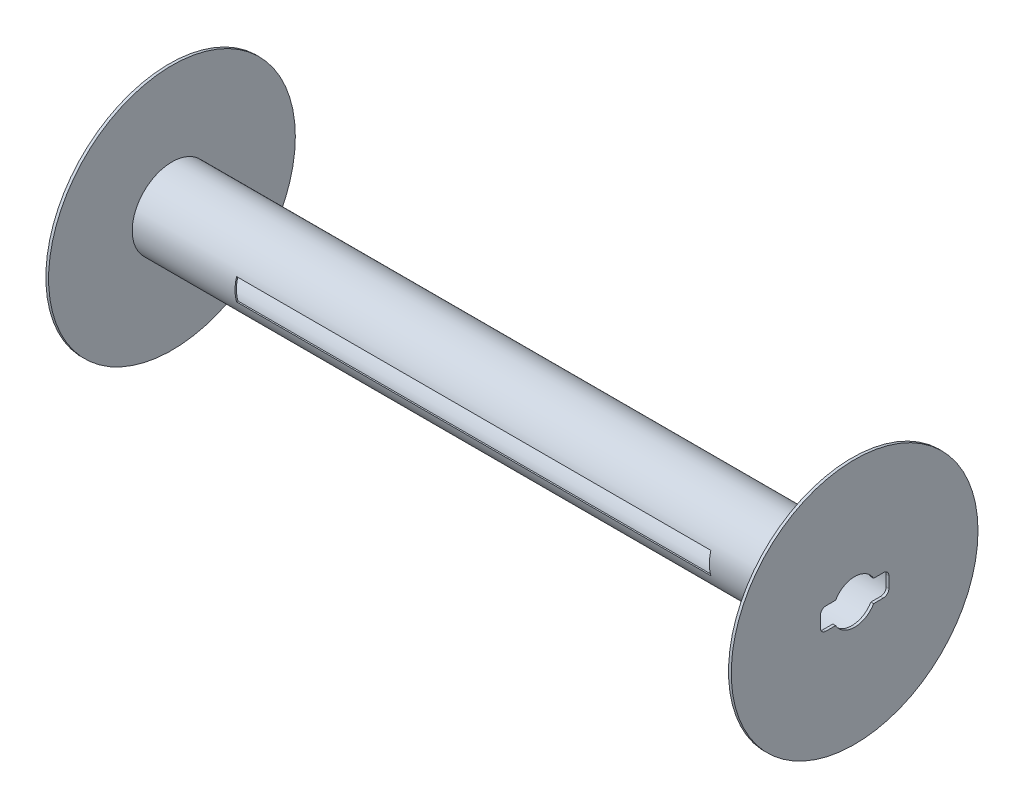
ISO-10303-21;
HEADER;
FILE_DESCRIPTION(('STEP AP214'),'2;1');
FILE_NAME('part.step','',(''),(''),'','','');
FILE_SCHEMA(('AUTOMOTIVE_DESIGN { 1 0 10303 214 1 1 1 1 }'));
ENDSEC;
DATA;
#1=APPLICATION_CONTEXT('core data for automotive mechanical design processes');
#2=APPLICATION_PROTOCOL_DEFINITION('international standard','automotive_design',2000,#1);
#3=PRODUCT_CONTEXT('',#1,'mechanical');
#4=PRODUCT('Part','Part','',(#3));
#5=PRODUCT_RELATED_PRODUCT_CATEGORY('part','',(#4));
#6=PRODUCT_DEFINITION_FORMATION('','',#4);
#7=PRODUCT_DEFINITION_CONTEXT('part definition',#1,'design');
#8=PRODUCT_DEFINITION('design','',#6,#7);
#9=PRODUCT_DEFINITION_SHAPE('','',#8);
#10=(LENGTH_UNIT() NAMED_UNIT(*) SI_UNIT(.MILLI.,.METRE.));
#11=(NAMED_UNIT(*) PLANE_ANGLE_UNIT() SI_UNIT($,.RADIAN.));
#12=(NAMED_UNIT(*) SI_UNIT($,.STERADIAN.) SOLID_ANGLE_UNIT());
#13=UNCERTAINTY_MEASURE_WITH_UNIT(LENGTH_MEASURE(1.E-05),#10,'distance_accuracy_value','');
#14=(GEOMETRIC_REPRESENTATION_CONTEXT(3) GLOBAL_UNCERTAINTY_ASSIGNED_CONTEXT((#13)) GLOBAL_UNIT_ASSIGNED_CONTEXT((#10,
#11,#12)) REPRESENTATION_CONTEXT('',''));
#15=CARTESIAN_POINT('',(0.,0.,0.));
#16=DIRECTION('',(0.,0.,1.));
#17=DIRECTION('',(1.,0.,0.));
#18=AXIS2_PLACEMENT_3D('',#15,#16,#17);
#19=CARTESIAN_POINT('',(0.,0.,0.));
#20=DIRECTION('',(1.,0.,0.));
#21=DIRECTION('',(0.,0.,-1.));
#22=AXIS2_PLACEMENT_3D('',#19,#20,#21);
#23=PLANE('',#22);
#24=CARTESIAN_POINT('',(0.,0.,0.));
#25=DIRECTION('',(1.,0.,0.));
#26=DIRECTION('',(0.,0.,-1.));
#27=AXIS2_PLACEMENT_3D('',#24,#25,#26);
#28=CIRCLE('',#27,11.43);
#29=CARTESIAN_POINT('',(0.,0.,-11.43));
#30=VERTEX_POINT('',#29);
#31=EDGE_CURVE('E522',#30,#30,#28,.T.);
#32=ORIENTED_EDGE('',*,*,#31,.F.);
#33=EDGE_LOOP('',(#32));
#34=FACE_BOUND('',#33,.T.);
#35=DIRECTION('',(0.,0.,-1.));
#36=VECTOR('',#35,1.);
#37=CARTESIAN_POINT('',(0.,1.016,0.));
#38=LINE('',#37,#36);
#39=CARTESIAN_POINT('',(0.,1.016,2.667));
#40=VERTEX_POINT('',#39);
#41=CARTESIAN_POINT('',(0.,1.016,1.75976362048998));
#42=VERTEX_POINT('',#41);
#43=EDGE_CURVE('E257',#40,#42,#38,.T.);
#44=ORIENTED_EDGE('',*,*,#43,.F.);
#45=CARTESIAN_POINT('',(0.,0.508,2.667));
#46=DIRECTION('',(1.,0.,0.));
#47=DIRECTION('',(0.,0.,-1.));
#48=AXIS2_PLACEMENT_3D('',#45,#46,#47);
#49=CIRCLE('',#48,0.508);
#50=CARTESIAN_POINT('',(0.,0.508,3.175));
#51=VERTEX_POINT('',#50);
#52=EDGE_CURVE('E267',#40,#51,#49,.T.);
#53=ORIENTED_EDGE('',*,*,#52,.T.);
#54=DIRECTION('',(0.,1.,0.));
#55=VECTOR('',#54,1.);
#56=CARTESIAN_POINT('',(0.,0.,3.175));
#57=LINE('',#56,#55);
#58=CARTESIAN_POINT('',(0.,-0.508,3.175));
#59=VERTEX_POINT('',#58);
#60=EDGE_CURVE('E272',#59,#51,#57,.T.);
#61=ORIENTED_EDGE('',*,*,#60,.F.);
#62=CARTESIAN_POINT('',(0.,-0.508,2.667));
#63=DIRECTION('',(1.,0.,0.));
#64=DIRECTION('',(0.,0.,-1.));
#65=AXIS2_PLACEMENT_3D('',#62,#63,#64);
#66=CIRCLE('',#65,0.508);
#67=CARTESIAN_POINT('',(0.,-1.016,2.667));
#68=VERTEX_POINT('',#67);
#69=EDGE_CURVE('E290',#59,#68,#66,.T.);
#70=ORIENTED_EDGE('',*,*,#69,.T.);
#71=DIRECTION('',(0.,0.,1.));
#72=VECTOR('',#71,1.);
#73=CARTESIAN_POINT('',(0.,-1.016,0.));
#74=LINE('',#73,#72);
#75=CARTESIAN_POINT('',(0.,-1.016,1.75976362048998));
#76=VERTEX_POINT('',#75);
#77=EDGE_CURVE('E294',#76,#68,#74,.T.);
#78=ORIENTED_EDGE('',*,*,#77,.F.);
#79=CARTESIAN_POINT('',(0.,0.,0.));
#80=DIRECTION('',(1.,0.,0.));
#81=DIRECTION('',(0.,0.,-1.));
#82=AXIS2_PLACEMENT_3D('',#79,#80,#81);
#83=CIRCLE('',#82,2.032);
#84=CARTESIAN_POINT('',(0.,-1.016,-1.75976362048998));
#85=VERTEX_POINT('',#84);
#86=EDGE_CURVE('E297',#76,#85,#83,.T.);
#87=ORIENTED_EDGE('',*,*,#86,.T.);
#88=DIRECTION('',(0.,0.,1.));
#89=VECTOR('',#88,1.);
#90=CARTESIAN_POINT('',(0.,-1.016,0.));
#91=LINE('',#90,#89);
#92=CARTESIAN_POINT('',(0.,-1.016,-2.667));
#93=VERTEX_POINT('',#92);
#94=EDGE_CURVE('E301',#93,#85,#91,.T.);
#95=ORIENTED_EDGE('',*,*,#94,.F.);
#96=CARTESIAN_POINT('',(0.,-0.507999999999999,-2.667));
#97=DIRECTION('',(1.,0.,0.));
#98=DIRECTION('',(0.,0.,-1.));
#99=AXIS2_PLACEMENT_3D('',#96,#97,#98);
#100=CIRCLE('',#99,0.508);
#101=CARTESIAN_POINT('',(0.,-0.508,-3.175));
#102=VERTEX_POINT('',#101);
#103=EDGE_CURVE('E304',#102,#93,#100,.F.);
#104=ORIENTED_EDGE('',*,*,#103,.F.);
#105=DIRECTION('',(0.,1.,0.));
#106=VECTOR('',#105,1.);
#107=CARTESIAN_POINT('',(0.,0.,-3.175));
#108=LINE('',#107,#106);
#109=CARTESIAN_POINT('',(0.,0.508,-3.175));
#110=VERTEX_POINT('',#109);
#111=EDGE_CURVE('E307',#102,#110,#108,.T.);
#112=ORIENTED_EDGE('',*,*,#111,.T.);
#113=CARTESIAN_POINT('',(0.,0.508,-2.667));
#114=DIRECTION('',(1.,0.,0.));
#115=DIRECTION('',(0.,0.,-1.));
#116=AXIS2_PLACEMENT_3D('',#113,#114,#115);
#117=CIRCLE('',#116,0.508);
#118=CARTESIAN_POINT('',(0.,1.016,-2.667));
#119=VERTEX_POINT('',#118);
#120=EDGE_CURVE('E311',#119,#110,#117,.F.);
#121=ORIENTED_EDGE('',*,*,#120,.F.);
#122=DIRECTION('',(0.,0.,1.));
#123=VECTOR('',#122,1.);
#124=CARTESIAN_POINT('',(0.,1.016,0.));
#125=LINE('',#124,#123);
#126=CARTESIAN_POINT('',(0.,1.016,-1.75976362048998));
#127=VERTEX_POINT('',#126);
#128=EDGE_CURVE('E314',#119,#127,#125,.T.);
#129=ORIENTED_EDGE('',*,*,#128,.T.);
#130=EDGE_CURVE('E277',#127,#42,#83,.T.);
#131=ORIENTED_EDGE('',*,*,#130,.T.);
#132=EDGE_LOOP('',(#44,#53,#61,#70,#78,#87,#95,#104,#112,#121,#129,#131));
#133=FACE_BOUND('',#132,.T.);
#134=ADVANCED_FACE('F43',(#34,#133),#23,.F.);
#135=CARTESIAN_POINT('',(63.5,0.,0.));
#136=DIRECTION('',(1.,0.,0.));
#137=DIRECTION('',(0.,0.,-1.));
#138=AXIS2_PLACEMENT_3D('',#135,#136,#137);
#139=PLANE('',#138);
#140=CARTESIAN_POINT('',(63.5,0.,0.));
#141=DIRECTION('',(1.,0.,0.));
#142=DIRECTION('',(0.,0.,-1.));
#143=AXIS2_PLACEMENT_3D('',#140,#141,#142);
#144=CIRCLE('',#143,11.43);
#145=CARTESIAN_POINT('',(63.5,0.,-11.43));
#146=VERTEX_POINT('',#145);
#147=EDGE_CURVE('E506',#146,#146,#144,.T.);
#148=ORIENTED_EDGE('',*,*,#147,.T.);
#149=EDGE_LOOP('',(#148));
#150=FACE_BOUND('',#149,.T.);
#151=CARTESIAN_POINT('',(63.5,0.508,2.667));
#152=DIRECTION('',(1.,0.,0.));
#153=DIRECTION('',(0.,0.,-1.));
#154=AXIS2_PLACEMENT_3D('',#151,#152,#153);
#155=CIRCLE('',#154,0.508);
#156=CARTESIAN_POINT('',(63.5,1.016,2.667));
#157=VERTEX_POINT('',#156);
#158=CARTESIAN_POINT('',(63.5,0.508,3.175));
#159=VERTEX_POINT('',#158);
#160=EDGE_CURVE('E319',#157,#159,#155,.T.);
#161=ORIENTED_EDGE('',*,*,#160,.F.);
#162=DIRECTION('',(0.,0.,-1.));
#163=VECTOR('',#162,1.);
#164=CARTESIAN_POINT('',(63.5,1.016,0.));
#165=LINE('',#164,#163);
#166=CARTESIAN_POINT('',(63.5,1.016,1.75976362048998));
#167=VERTEX_POINT('',#166);
#168=EDGE_CURVE('E67',#157,#167,#165,.T.);
#169=ORIENTED_EDGE('',*,*,#168,.T.);
#170=CARTESIAN_POINT('',(63.5,0.,0.));
#171=DIRECTION('',(1.,0.,0.));
#172=DIRECTION('',(0.,0.,-1.));
#173=AXIS2_PLACEMENT_3D('',#170,#171,#172);
#174=CIRCLE('',#173,2.032);
#175=CARTESIAN_POINT('',(63.5,1.016,-1.75976362048998));
#176=VERTEX_POINT('',#175);
#177=EDGE_CURVE('E279',#176,#167,#174,.T.);
#178=ORIENTED_EDGE('',*,*,#177,.F.);
#179=DIRECTION('',(0.,0.,1.));
#180=VECTOR('',#179,1.);
#181=CARTESIAN_POINT('',(63.5,1.016,0.));
#182=LINE('',#181,#180);
#183=CARTESIAN_POINT('',(63.5,1.016,-2.667));
#184=VERTEX_POINT('',#183);
#185=EDGE_CURVE('E284',#184,#176,#182,.T.);
#186=ORIENTED_EDGE('',*,*,#185,.F.);
#187=CARTESIAN_POINT('',(63.5,0.508,-2.667));
#188=DIRECTION('',(1.,0.,0.));
#189=DIRECTION('',(0.,0.,-1.));
#190=AXIS2_PLACEMENT_3D('',#187,#188,#189);
#191=CIRCLE('',#190,0.508);
#192=CARTESIAN_POINT('',(63.5,0.508,-3.175));
#193=VERTEX_POINT('',#192);
#194=EDGE_CURVE('E349',#184,#193,#191,.F.);
#195=ORIENTED_EDGE('',*,*,#194,.T.);
#196=DIRECTION('',(0.,1.,0.));
#197=VECTOR('',#196,1.);
#198=CARTESIAN_POINT('',(63.5,0.,-3.175));
#199=LINE('',#198,#197);
#200=CARTESIAN_POINT('',(63.5,-0.508,-3.175));
#201=VERTEX_POINT('',#200);
#202=EDGE_CURVE('E345',#201,#193,#199,.T.);
#203=ORIENTED_EDGE('',*,*,#202,.F.);
#204=CARTESIAN_POINT('',(63.5,-0.507999999999999,-2.667));
#205=DIRECTION('',(1.,0.,0.));
#206=DIRECTION('',(0.,0.,-1.));
#207=AXIS2_PLACEMENT_3D('',#204,#205,#206);
#208=CIRCLE('',#207,0.508);
#209=CARTESIAN_POINT('',(63.5,-1.016,-2.667));
#210=VERTEX_POINT('',#209);
#211=EDGE_CURVE('E341',#201,#210,#208,.F.);
#212=ORIENTED_EDGE('',*,*,#211,.T.);
#213=DIRECTION('',(0.,0.,1.));
#214=VECTOR('',#213,1.);
#215=CARTESIAN_POINT('',(63.5,-1.016,0.));
#216=LINE('',#215,#214);
#217=CARTESIAN_POINT('',(63.5,-1.016,-1.75976362048998));
#218=VERTEX_POINT('',#217);
#219=EDGE_CURVE('E337',#210,#218,#216,.T.);
#220=ORIENTED_EDGE('',*,*,#219,.T.);
#221=CARTESIAN_POINT('',(63.5,-1.016,1.75976362048998));
#222=VERTEX_POINT('',#221);
#223=EDGE_CURVE('E286',#222,#218,#174,.T.);
#224=ORIENTED_EDGE('',*,*,#223,.F.);
#225=DIRECTION('',(0.,0.,1.));
#226=VECTOR('',#225,1.);
#227=CARTESIAN_POINT('',(63.5,-1.016,0.));
#228=LINE('',#227,#226);
#229=CARTESIAN_POINT('',(63.5,-1.016,2.667));
#230=VERTEX_POINT('',#229);
#231=EDGE_CURVE('E331',#222,#230,#228,.T.);
#232=ORIENTED_EDGE('',*,*,#231,.T.);
#233=CARTESIAN_POINT('',(63.5,-0.508,2.667));
#234=DIRECTION('',(1.,0.,0.));
#235=DIRECTION('',(0.,0.,-1.));
#236=AXIS2_PLACEMENT_3D('',#233,#234,#235);
#237=CIRCLE('',#236,0.508);
#238=CARTESIAN_POINT('',(63.5,-0.508,3.175));
#239=VERTEX_POINT('',#238);
#240=EDGE_CURVE('E327',#239,#230,#237,.T.);
#241=ORIENTED_EDGE('',*,*,#240,.F.);
#242=DIRECTION('',(0.,1.,0.));
#243=VECTOR('',#242,1.);
#244=CARTESIAN_POINT('',(63.5,0.,3.175));
#245=LINE('',#244,#243);
#246=EDGE_CURVE('E323',#239,#159,#245,.T.);
#247=ORIENTED_EDGE('',*,*,#246,.T.);
#248=EDGE_LOOP('',(#161,#169,#178,#186,#195,#203,#212,#220,#224,#232,#241,#247));
#249=FACE_BOUND('',#248,.T.);
#250=ADVANCED_FACE('F667',(#150,#249),#139,.T.);
#251=CARTESIAN_POINT('',(0.254,0.,0.));
#252=DIRECTION('',(1.,0.,0.));
#253=DIRECTION('',(0.,0.,-1.));
#254=AXIS2_PLACEMENT_3D('',#251,#252,#253);
#255=PLANE('',#254);
#256=CARTESIAN_POINT('',(0.254000000000004,0.,0.));
#257=DIRECTION('',(1.,0.,0.));
#258=DIRECTION('',(0.,0.,-1.));
#259=AXIS2_PLACEMENT_3D('',#256,#257,#258);
#260=CIRCLE('',#259,3.556);
#261=CARTESIAN_POINT('',(0.254000000000004,0.,-3.556));
#262=VERTEX_POINT('',#261);
#263=EDGE_CURVE('E530',#262,#262,#260,.F.);
#264=ORIENTED_EDGE('',*,*,#263,.F.);
#265=EDGE_LOOP('',(#264));
#266=FACE_BOUND('',#265,.T.);
#267=CARTESIAN_POINT('',(0.254,0.508,2.667));
#268=DIRECTION('',(1.,0.,0.));
#269=DIRECTION('',(0.,0.,-1.));
#270=AXIS2_PLACEMENT_3D('',#267,#268,#269);
#271=CIRCLE('',#270,0.508);
#272=CARTESIAN_POINT('',(0.254,1.016,2.667));
#273=VERTEX_POINT('',#272);
#274=CARTESIAN_POINT('',(0.254,0.508,3.175));
#275=VERTEX_POINT('',#274);
#276=EDGE_CURVE('E359',#273,#275,#271,.T.);
#277=ORIENTED_EDGE('',*,*,#276,.F.);
#278=DIRECTION('',(0.,0.,-1.));
#279=VECTOR('',#278,1.);
#280=CARTESIAN_POINT('',(0.254,1.016,0.));
#281=LINE('',#280,#279);
#282=CARTESIAN_POINT('',(0.254,1.016,1.75976362048998));
#283=VERTEX_POINT('',#282);
#284=EDGE_CURVE('E260',#273,#283,#281,.T.);
#285=ORIENTED_EDGE('',*,*,#284,.T.);
#286=CARTESIAN_POINT('',(0.254,0.,0.));
#287=DIRECTION('',(1.,0.,0.));
#288=DIRECTION('',(0.,0.,-1.));
#289=AXIS2_PLACEMENT_3D('',#286,#287,#288);
#290=CIRCLE('',#289,2.032);
#291=CARTESIAN_POINT('',(0.254,1.016,-1.75976362048998));
#292=VERTEX_POINT('',#291);
#293=EDGE_CURVE('E442',#292,#283,#290,.T.);
#294=ORIENTED_EDGE('',*,*,#293,.F.);
#295=DIRECTION('',(0.,0.,1.));
#296=VECTOR('',#295,1.);
#297=CARTESIAN_POINT('',(0.254,1.016,0.));
#298=LINE('',#297,#296);
#299=CARTESIAN_POINT('',(0.254,1.016,-2.667));
#300=VERTEX_POINT('',#299);
#301=EDGE_CURVE('E439',#300,#292,#298,.T.);
#302=ORIENTED_EDGE('',*,*,#301,.F.);
#303=CARTESIAN_POINT('',(0.254,0.508,-2.667));
#304=DIRECTION('',(1.,0.,0.));
#305=DIRECTION('',(0.,0.,-1.));
#306=AXIS2_PLACEMENT_3D('',#303,#304,#305);
#307=CIRCLE('',#306,0.508);
#308=CARTESIAN_POINT('',(0.254,0.508,-3.175));
#309=VERTEX_POINT('',#308);
#310=EDGE_CURVE('E435',#300,#309,#307,.F.);
#311=ORIENTED_EDGE('',*,*,#310,.T.);
#312=DIRECTION('',(0.,1.,0.));
#313=VECTOR('',#312,1.);
#314=CARTESIAN_POINT('',(0.254,0.,-3.175));
#315=LINE('',#314,#313);
#316=CARTESIAN_POINT('',(0.254,-0.508,-3.175));
#317=VERTEX_POINT('',#316);
#318=EDGE_CURVE('E432',#317,#309,#315,.T.);
#319=ORIENTED_EDGE('',*,*,#318,.F.);
#320=CARTESIAN_POINT('',(0.254,-0.507999999999999,-2.667));
#321=DIRECTION('',(1.,0.,0.));
#322=DIRECTION('',(0.,0.,-1.));
#323=AXIS2_PLACEMENT_3D('',#320,#321,#322);
#324=CIRCLE('',#323,0.508);
#325=CARTESIAN_POINT('',(0.254,-1.016,-2.667));
#326=VERTEX_POINT('',#325);
#327=EDGE_CURVE('E428',#317,#326,#324,.F.);
#328=ORIENTED_EDGE('',*,*,#327,.T.);
#329=DIRECTION('',(0.,0.,1.));
#330=VECTOR('',#329,1.);
#331=CARTESIAN_POINT('',(0.254,-1.016,0.));
#332=LINE('',#331,#330);
#333=CARTESIAN_POINT('',(0.254,-1.016,-1.75976362048998));
#334=VERTEX_POINT('',#333);
#335=EDGE_CURVE('E424',#326,#334,#332,.T.);
#336=ORIENTED_EDGE('',*,*,#335,.T.);
#337=CARTESIAN_POINT('',(0.254,0.,0.));
#338=DIRECTION('',(1.,0.,0.));
#339=DIRECTION('',(0.,0.,-1.));
#340=AXIS2_PLACEMENT_3D('',#337,#338,#339);
#341=CIRCLE('',#340,2.032);
#342=CARTESIAN_POINT('',(0.254,-1.016,1.75976362048998));
#343=VERTEX_POINT('',#342);
#344=EDGE_CURVE('E421',#343,#334,#341,.T.);
#345=ORIENTED_EDGE('',*,*,#344,.F.);
#346=DIRECTION('',(0.,0.,1.));
#347=VECTOR('',#346,1.);
#348=CARTESIAN_POINT('',(0.254,-1.016,0.));
#349=LINE('',#348,#347);
#350=CARTESIAN_POINT('',(0.254,-1.016,2.667));
#351=VERTEX_POINT('',#350);
#352=EDGE_CURVE('E417',#343,#351,#349,.T.);
#353=ORIENTED_EDGE('',*,*,#352,.T.);
#354=CARTESIAN_POINT('',(0.254,-0.508,2.667));
#355=DIRECTION('',(1.,0.,0.));
#356=DIRECTION('',(0.,0.,-1.));
#357=AXIS2_PLACEMENT_3D('',#354,#355,#356);
#358=CIRCLE('',#357,0.508);
#359=CARTESIAN_POINT('',(0.254,-0.508,3.175));
#360=VERTEX_POINT('',#359);
#361=EDGE_CURVE('E414',#360,#351,#358,.T.);
#362=ORIENTED_EDGE('',*,*,#361,.F.);
#363=DIRECTION('',(0.,1.,0.));
#364=VECTOR('',#363,1.);
#365=CARTESIAN_POINT('',(0.254,0.,3.175));
#366=LINE('',#365,#364);
#367=EDGE_CURVE('E410',#360,#275,#366,.T.);
#368=ORIENTED_EDGE('',*,*,#367,.T.);
#369=EDGE_LOOP('',(#277,#285,#294,#302,#311,#319,#328,#336,#345,#353,#362,#368));
#370=FACE_BOUND('',#369,.T.);
#371=ADVANCED_FACE('F721',(#266,#370),#255,.T.);
#372=CARTESIAN_POINT('',(63.246,0.,0.));
#373=DIRECTION('',(1.,0.,0.));
#374=DIRECTION('',(0.,0.,-1.));
#375=AXIS2_PLACEMENT_3D('',#372,#373,#374);
#376=PLANE('',#375);
#377=CARTESIAN_POINT('',(63.246,0.,0.));
#378=DIRECTION('',(1.,0.,0.));
#379=DIRECTION('',(0.,0.,-1.));
#380=AXIS2_PLACEMENT_3D('',#377,#378,#379);
#381=CIRCLE('',#380,3.556);
#382=CARTESIAN_POINT('',(63.246,0.,-3.556));
#383=VERTEX_POINT('',#382);
#384=EDGE_CURVE('E510',#383,#383,#381,.T.);
#385=ORIENTED_EDGE('',*,*,#384,.F.);
#386=EDGE_LOOP('',(#385));
#387=FACE_BOUND('',#386,.T.);
#388=DIRECTION('',(0.,0.,-1.));
#389=VECTOR('',#388,1.);
#390=CARTESIAN_POINT('',(63.246,1.016,0.));
#391=LINE('',#390,#389);
#392=CARTESIAN_POINT('',(63.246,1.016,2.667));
#393=VERTEX_POINT('',#392);
#394=CARTESIAN_POINT('',(63.246,1.016,1.75976362048998));
#395=VERTEX_POINT('',#394);
#396=EDGE_CURVE('E11',#393,#395,#391,.T.);
#397=ORIENTED_EDGE('',*,*,#396,.F.);
#398=CARTESIAN_POINT('',(63.246,0.508,2.667));
#399=DIRECTION('',(1.,0.,0.));
#400=DIRECTION('',(0.,0.,-1.));
#401=AXIS2_PLACEMENT_3D('',#398,#399,#400);
#402=CIRCLE('',#401,0.508);
#403=CARTESIAN_POINT('',(63.246,0.508,3.175));
#404=VERTEX_POINT('',#403);
#405=EDGE_CURVE('E566',#393,#404,#402,.T.);
#406=ORIENTED_EDGE('',*,*,#405,.T.);
#407=DIRECTION('',(0.,1.,0.));
#408=VECTOR('',#407,1.);
#409=CARTESIAN_POINT('',(63.246,0.,3.175));
#410=LINE('',#409,#408);
#411=CARTESIAN_POINT('',(63.246,-0.508,3.175));
#412=VERTEX_POINT('',#411);
#413=EDGE_CURVE('E570',#412,#404,#410,.T.);
#414=ORIENTED_EDGE('',*,*,#413,.F.);
#415=CARTESIAN_POINT('',(63.246,-0.508,2.667));
#416=DIRECTION('',(1.,0.,0.));
#417=DIRECTION('',(0.,0.,-1.));
#418=AXIS2_PLACEMENT_3D('',#415,#416,#417);
#419=CIRCLE('',#418,0.508);
#420=CARTESIAN_POINT('',(63.246,-1.016,2.667));
#421=VERTEX_POINT('',#420);
#422=EDGE_CURVE('E574',#412,#421,#419,.T.);
#423=ORIENTED_EDGE('',*,*,#422,.T.);
#424=DIRECTION('',(0.,0.,1.));
#425=VECTOR('',#424,1.);
#426=CARTESIAN_POINT('',(63.246,-1.016,0.));
#427=LINE('',#426,#425);
#428=CARTESIAN_POINT('',(63.246,-1.016,1.75976362048998));
#429=VERTEX_POINT('',#428);
#430=EDGE_CURVE('E578',#429,#421,#427,.T.);
#431=ORIENTED_EDGE('',*,*,#430,.F.);
#432=CARTESIAN_POINT('',(63.246,0.,0.));
#433=DIRECTION('',(1.,0.,0.));
#434=DIRECTION('',(0.,0.,-1.));
#435=AXIS2_PLACEMENT_3D('',#432,#433,#434);
#436=CIRCLE('',#435,2.032);
#437=CARTESIAN_POINT('',(63.246,-1.016,-1.75976362048998));
#438=VERTEX_POINT('',#437);
#439=EDGE_CURVE('E581',#429,#438,#436,.T.);
#440=ORIENTED_EDGE('',*,*,#439,.T.);
#441=DIRECTION('',(0.,0.,1.));
#442=VECTOR('',#441,1.);
#443=CARTESIAN_POINT('',(63.246,-1.016,0.));
#444=LINE('',#443,#442);
#445=CARTESIAN_POINT('',(63.246,-1.016,-2.667));
#446=VERTEX_POINT('',#445);
#447=EDGE_CURVE('E585',#446,#438,#444,.T.);
#448=ORIENTED_EDGE('',*,*,#447,.F.);
#449=CARTESIAN_POINT('',(63.246,-0.507999999999999,-2.667));
#450=DIRECTION('',(1.,0.,0.));
#451=DIRECTION('',(0.,0.,-1.));
#452=AXIS2_PLACEMENT_3D('',#449,#450,#451);
#453=CIRCLE('',#452,0.508);
#454=CARTESIAN_POINT('',(63.246,-0.508,-3.175));
#455=VERTEX_POINT('',#454);
#456=EDGE_CURVE('E588',#455,#446,#453,.F.);
#457=ORIENTED_EDGE('',*,*,#456,.F.);
#458=DIRECTION('',(0.,1.,0.));
#459=VECTOR('',#458,1.);
#460=CARTESIAN_POINT('',(63.246,0.,-3.175));
#461=LINE('',#460,#459);
#462=CARTESIAN_POINT('',(63.246,0.508,-3.175));
#463=VERTEX_POINT('',#462);
#464=EDGE_CURVE('E591',#455,#463,#461,.T.);
#465=ORIENTED_EDGE('',*,*,#464,.T.);
#466=CARTESIAN_POINT('',(63.246,0.508,-2.667));
#467=DIRECTION('',(1.,0.,0.));
#468=DIRECTION('',(0.,0.,-1.));
#469=AXIS2_PLACEMENT_3D('',#466,#467,#468);
#470=CIRCLE('',#469,0.508);
#471=CARTESIAN_POINT('',(63.246,1.016,-2.667));
#472=VERTEX_POINT('',#471);
#473=EDGE_CURVE('E595',#472,#463,#470,.F.);
#474=ORIENTED_EDGE('',*,*,#473,.F.);
#475=DIRECTION('',(0.,0.,1.));
#476=VECTOR('',#475,1.);
#477=CARTESIAN_POINT('',(63.246,1.016,0.));
#478=LINE('',#477,#476);
#479=CARTESIAN_POINT('',(63.246,1.016,-1.75976362048998));
#480=VERTEX_POINT('',#479);
#481=EDGE_CURVE('E598',#472,#480,#478,.T.);
#482=ORIENTED_EDGE('',*,*,#481,.T.);
#483=CARTESIAN_POINT('',(63.246,0.,0.));
#484=DIRECTION('',(1.,0.,0.));
#485=DIRECTION('',(0.,0.,-1.));
#486=AXIS2_PLACEMENT_3D('',#483,#484,#485);
#487=CIRCLE('',#486,2.032);
#488=EDGE_CURVE('E52',#480,#395,#487,.T.);
#489=ORIENTED_EDGE('',*,*,#488,.T.);
#490=EDGE_LOOP('',(#397,#406,#414,#423,#431,#440,#448,#457,#465,#474,#482,#489));
#491=FACE_BOUND('',#490,.T.);
#492=ADVANCED_FACE('F606',(#387,#491),#376,.F.);
#493=CARTESIAN_POINT('',(63.246,0.,0.));
#494=DIRECTION('',(-1.,0.,0.));
#495=DIRECTION('',(0.,0.,1.));
#496=AXIS2_PLACEMENT_3D('',#493,#494,#495);
#497=CYLINDRICAL_SURFACE('',#496,3.683);
#498=CARTESIAN_POINT('',(9.779,0.,0.));
#499=DIRECTION('',(-1.,0.,0.));
#500=DIRECTION('',(0.,0.,1.));
#501=AXIS2_PLACEMENT_3D('',#498,#499,#500);
#502=CIRCLE('',#501,3.683);
#503=CARTESIAN_POINT('',(9.779,-1.016,3.54008940565065));
#504=VERTEX_POINT('',#503);
#505=CARTESIAN_POINT('',(9.779,1.016,3.54008940565065));
#506=VERTEX_POINT('',#505);
#507=EDGE_CURVE('E502',#504,#506,#502,.T.);
#508=ORIENTED_EDGE('',*,*,#507,.T.);
#509=DIRECTION('',(-1.,0.,0.));
#510=VECTOR('',#509,1.);
#511=CARTESIAN_POINT('',(63.246,1.016,3.54008940565065));
#512=LINE('',#511,#510);
#513=CARTESIAN_POINT('',(53.721,1.016,3.54008940565065));
#514=VERTEX_POINT('',#513);
#515=EDGE_CURVE('E498',#506,#514,#512,.F.);
#516=ORIENTED_EDGE('',*,*,#515,.T.);
#517=CARTESIAN_POINT('',(53.721,0.,0.));
#518=DIRECTION('',(1.,0.,0.));
#519=DIRECTION('',(0.,0.,-1.));
#520=AXIS2_PLACEMENT_3D('',#517,#518,#519);
#521=CIRCLE('',#520,3.683);
#522=CARTESIAN_POINT('',(53.721,-1.016,3.54008940565065));
#523=VERTEX_POINT('',#522);
#524=EDGE_CURVE('E495',#514,#523,#521,.T.);
#525=ORIENTED_EDGE('',*,*,#524,.T.);
#526=DIRECTION('',(-1.,0.,0.));
#527=VECTOR('',#526,1.);
#528=CARTESIAN_POINT('',(63.246,-1.016,3.54008940565065));
#529=LINE('',#528,#527);
#530=EDGE_CURVE('E481',#523,#504,#529,.T.);
#531=ORIENTED_EDGE('',*,*,#530,.T.);
#532=EDGE_LOOP('',(#508,#516,#525,#531));
#533=FACE_BOUND('',#532,.T.);
#534=CARTESIAN_POINT('',(63.246,0.,0.));
#535=DIRECTION('',(1.,0.,0.));
#536=DIRECTION('',(0.,0.,-1.));
#537=AXIS2_PLACEMENT_3D('',#534,#535,#536);
#538=CIRCLE('',#537,3.683);
#539=CARTESIAN_POINT('',(63.246,0.,-3.683));
#540=VERTEX_POINT('',#539);
#541=EDGE_CURVE('E518',#540,#540,#538,.T.);
#542=ORIENTED_EDGE('',*,*,#541,.F.);
#543=EDGE_LOOP('',(#542));
#544=FACE_BOUND('',#543,.T.);
#545=CARTESIAN_POINT('',(0.254,0.,0.));
#546=DIRECTION('',(1.,0.,0.));
#547=DIRECTION('',(0.,0.,-1.));
#548=AXIS2_PLACEMENT_3D('',#545,#546,#547);
#549=CIRCLE('',#548,3.683);
#550=CARTESIAN_POINT('',(0.254,0.,-3.683));
#551=VERTEX_POINT('',#550);
#552=EDGE_CURVE('E517',#551,#551,#549,.T.);
#553=ORIENTED_EDGE('',*,*,#552,.T.);
#554=EDGE_LOOP('',(#553));
#555=FACE_BOUND('',#554,.T.);
#556=CARTESIAN_POINT('',(49.149,0.,0.));
#557=DIRECTION('',(-1.,0.,0.));
#558=DIRECTION('',(0.,0.,1.));
#559=AXIS2_PLACEMENT_3D('',#556,#557,#558);
#560=CIRCLE('',#559,3.683);
#561=CARTESIAN_POINT('',(49.149,1.016,-3.54008940565065));
#562=VERTEX_POINT('',#561);
#563=CARTESIAN_POINT('',(49.149,-0.964001403299459,-3.55460128487523));
#564=VERTEX_POINT('',#563);
#565=EDGE_CURVE('E465',#562,#564,#560,.T.);
#566=ORIENTED_EDGE('',*,*,#565,.F.);
#567=DIRECTION('',(-1.,0.,0.));
#568=VECTOR('',#567,1.);
#569=CARTESIAN_POINT('',(63.246,1.016,-3.54008940565065));
#570=LINE('',#569,#568);
#571=CARTESIAN_POINT('',(14.351,1.016,-3.54008940565065));
#572=VERTEX_POINT('',#571);
#573=EDGE_CURVE('E462',#572,#562,#570,.F.);
#574=ORIENTED_EDGE('',*,*,#573,.F.);
#575=CARTESIAN_POINT('',(14.351,0.,0.));
#576=DIRECTION('',(1.,0.,0.));
#577=DIRECTION('',(0.,0.,-1.));
#578=AXIS2_PLACEMENT_3D('',#575,#576,#577);
#579=CIRCLE('',#578,3.683);
#580=CARTESIAN_POINT('',(14.351,-0.964001403299459,-3.55460128487523));
#581=VERTEX_POINT('',#580);
#582=EDGE_CURVE('E472',#581,#572,#579,.T.);
#583=ORIENTED_EDGE('',*,*,#582,.F.);
#584=DIRECTION('',(-1.,0.,0.));
#585=VECTOR('',#584,1.);
#586=CARTESIAN_POINT('',(63.246,-0.964001403299459,-3.55460128487523));
#587=LINE('',#586,#585);
#588=EDGE_CURVE('E468',#564,#581,#587,.T.);
#589=ORIENTED_EDGE('',*,*,#588,.F.);
#590=EDGE_LOOP('',(#566,#574,#583,#589));
#591=FACE_BOUND('',#590,.T.);
#592=ADVANCED_FACE('F731',(#533,#544,#555,#591),#497,.T.);
#593=CARTESIAN_POINT('',(63.246,0.,0.));
#594=DIRECTION('',(-1.,0.,0.));
#595=DIRECTION('',(0.,0.,1.));
#596=AXIS2_PLACEMENT_3D('',#593,#594,#595);
#597=CYLINDRICAL_SURFACE('',#596,3.556);
#598=CARTESIAN_POINT('',(9.779,0.,0.));
#599=DIRECTION('',(-1.,0.,0.));
#600=DIRECTION('',(0.,0.,1.));
#601=AXIS2_PLACEMENT_3D('',#598,#599,#600);
#602=CIRCLE('',#601,3.556);
#603=CARTESIAN_POINT('',(9.779,-1.016,3.40776759770968));
#604=VERTEX_POINT('',#603);
#605=CARTESIAN_POINT('',(9.779,1.016,3.40776759770968));
#606=VERTEX_POINT('',#605);
#607=EDGE_CURVE('E547',#604,#606,#602,.T.);
#608=ORIENTED_EDGE('',*,*,#607,.F.);
#609=DIRECTION('',(-1.,0.,0.));
#610=VECTOR('',#609,1.);
#611=CARTESIAN_POINT('',(63.246,-1.016,3.40776759770968));
#612=LINE('',#611,#610);
#613=CARTESIAN_POINT('',(53.721,-1.016,3.40776759770968));
#614=VERTEX_POINT('',#613);
#615=EDGE_CURVE('E537',#614,#604,#612,.T.);
#616=ORIENTED_EDGE('',*,*,#615,.F.);
#617=CARTESIAN_POINT('',(53.721,0.,0.));
#618=DIRECTION('',(1.,0.,0.));
#619=DIRECTION('',(0.,0.,-1.));
#620=AXIS2_PLACEMENT_3D('',#617,#618,#619);
#621=CIRCLE('',#620,3.556);
#622=CARTESIAN_POINT('',(53.721,1.016,3.40776759770968));
#623=VERTEX_POINT('',#622);
#624=EDGE_CURVE('E540',#623,#614,#621,.T.);
#625=ORIENTED_EDGE('',*,*,#624,.F.);
#626=DIRECTION('',(-1.,0.,0.));
#627=VECTOR('',#626,1.);
#628=CARTESIAN_POINT('',(63.246,1.016,3.40776759770968));
#629=LINE('',#628,#627);
#630=EDGE_CURVE('E544',#606,#623,#629,.F.);
#631=ORIENTED_EDGE('',*,*,#630,.F.);
#632=EDGE_LOOP('',(#608,#616,#625,#631));
#633=FACE_BOUND('',#632,.T.);
#634=ORIENTED_EDGE('',*,*,#384,.T.);
#635=EDGE_LOOP('',(#634));
#636=FACE_BOUND('',#635,.T.);
#637=ORIENTED_EDGE('',*,*,#263,.T.);
#638=EDGE_LOOP('',(#637));
#639=FACE_BOUND('',#638,.T.);
#640=DIRECTION('',(-1.,0.,0.));
#641=VECTOR('',#640,1.);
#642=CARTESIAN_POINT('',(63.246,-0.964001403299459,-3.42284053009144));
#643=LINE('',#642,#641);
#644=CARTESIAN_POINT('',(49.149,-0.964001403299459,-3.42284053009144));
#645=VERTEX_POINT('',#644);
#646=CARTESIAN_POINT('',(14.351,-0.964001403299459,-3.42284053009144));
#647=VERTEX_POINT('',#646);
#648=EDGE_CURVE('E558',#645,#647,#643,.T.);
#649=ORIENTED_EDGE('',*,*,#648,.T.);
#650=CARTESIAN_POINT('',(14.351,0.,0.));
#651=DIRECTION('',(1.,0.,0.));
#652=DIRECTION('',(0.,0.,-1.));
#653=AXIS2_PLACEMENT_3D('',#650,#651,#652);
#654=CIRCLE('',#653,3.556);
#655=CARTESIAN_POINT('',(14.351,1.016,-3.40776759770968));
#656=VERTEX_POINT('',#655);
#657=EDGE_CURVE('E562',#647,#656,#654,.T.);
#658=ORIENTED_EDGE('',*,*,#657,.T.);
#659=DIRECTION('',(-1.,0.,0.));
#660=VECTOR('',#659,1.);
#661=CARTESIAN_POINT('',(63.246,1.016,-3.40776759770968));
#662=LINE('',#661,#660);
#663=CARTESIAN_POINT('',(49.149,1.016,-3.40776759770968));
#664=VERTEX_POINT('',#663);
#665=EDGE_CURVE('E550',#656,#664,#662,.F.);
#666=ORIENTED_EDGE('',*,*,#665,.T.);
#667=CARTESIAN_POINT('',(49.149,0.,0.));
#668=DIRECTION('',(-1.,0.,0.));
#669=DIRECTION('',(0.,0.,1.));
#670=AXIS2_PLACEMENT_3D('',#667,#668,#669);
#671=CIRCLE('',#670,3.556);
#672=EDGE_CURVE('E554',#664,#645,#671,.T.);
#673=ORIENTED_EDGE('',*,*,#672,.T.);
#674=EDGE_LOOP('',(#649,#658,#666,#673));
#675=FACE_BOUND('',#674,.T.);
#676=ADVANCED_FACE('F734',(#633,#636,#639,#675),#597,.F.);
#677=CARTESIAN_POINT('',(0.254,0.,0.));
#678=DIRECTION('',(-1.,0.,0.));
#679=DIRECTION('',(0.,0.,1.));
#680=AXIS2_PLACEMENT_3D('',#677,#678,#679);
#681=CYLINDRICAL_SURFACE('',#680,11.43);
#682=CARTESIAN_POINT('',(0.254,0.,0.));
#683=DIRECTION('',(1.,0.,0.));
#684=DIRECTION('',(0.,0.,-1.));
#685=AXIS2_PLACEMENT_3D('',#682,#683,#684);
#686=CIRCLE('',#685,11.43);
#687=CARTESIAN_POINT('',(0.254,0.,-11.43));
#688=VERTEX_POINT('',#687);
#689=EDGE_CURVE('E526',#688,#688,#686,.T.);
#690=ORIENTED_EDGE('',*,*,#689,.F.);
#691=EDGE_LOOP('',(#690));
#692=FACE_BOUND('',#691,.T.);
#693=ORIENTED_EDGE('',*,*,#31,.T.);
#694=EDGE_LOOP('',(#693));
#695=FACE_BOUND('',#694,.T.);
#696=ADVANCED_FACE('F45',(#692,#695),#681,.T.);
#697=ORIENTED_EDGE('',*,*,#552,.F.);
#698=EDGE_LOOP('',(#697));
#699=FACE_BOUND('',#698,.T.);
#700=ORIENTED_EDGE('',*,*,#689,.T.);
#701=EDGE_LOOP('',(#700));
#702=FACE_BOUND('',#701,.T.);
#703=ADVANCED_FACE('F726',(#699,#702),#255,.T.);
#704=CARTESIAN_POINT('',(63.5,0.,0.));
#705=DIRECTION('',(-1.,0.,0.));
#706=DIRECTION('',(0.,0.,1.));
#707=AXIS2_PLACEMENT_3D('',#704,#705,#706);
#708=CYLINDRICAL_SURFACE('',#707,11.43);
#709=ORIENTED_EDGE('',*,*,#147,.F.);
#710=EDGE_LOOP('',(#709));
#711=FACE_BOUND('',#710,.T.);
#712=CARTESIAN_POINT('',(63.246,0.,0.));
#713=DIRECTION('',(1.,0.,0.));
#714=DIRECTION('',(0.,0.,-1.));
#715=AXIS2_PLACEMENT_3D('',#712,#713,#714);
#716=CIRCLE('',#715,11.43);
#717=CARTESIAN_POINT('',(63.246,0.,-11.43));
#718=VERTEX_POINT('',#717);
#719=EDGE_CURVE('E505',#718,#718,#716,.T.);
#720=ORIENTED_EDGE('',*,*,#719,.T.);
#721=EDGE_LOOP('',(#720));
#722=FACE_BOUND('',#721,.T.);
#723=ADVANCED_FACE('F729',(#711,#722),#708,.T.);
#724=ORIENTED_EDGE('',*,*,#541,.T.);
#725=EDGE_LOOP('',(#724));
#726=FACE_BOUND('',#725,.T.);
#727=ORIENTED_EDGE('',*,*,#719,.F.);
#728=EDGE_LOOP('',(#727));
#729=FACE_BOUND('',#728,.T.);
#730=ADVANCED_FACE('F741',(#726,#729),#376,.F.);
#731=CARTESIAN_POINT('',(9.779,1.016,0.889));
#732=DIRECTION('',(-1.,0.,0.));
#733=DIRECTION('',(0.,0.,1.));
#734=AXIS2_PLACEMENT_3D('',#731,#732,#733);
#735=PLANE('',#734);
#736=ORIENTED_EDGE('',*,*,#507,.F.);
#737=DIRECTION('',(0.,0.,1.));
#738=VECTOR('',#737,1.);
#739=CARTESIAN_POINT('',(9.779,-1.016,0.889));
#740=LINE('',#739,#738);
#741=EDGE_CURVE('E476',#604,#504,#740,.T.);
#742=ORIENTED_EDGE('',*,*,#741,.F.);
#743=ORIENTED_EDGE('',*,*,#607,.T.);
#744=DIRECTION('',(0.,0.,1.));
#745=VECTOR('',#744,1.);
#746=CARTESIAN_POINT('',(9.779,1.016,0.889));
#747=LINE('',#746,#745);
#748=EDGE_CURVE('E477',#606,#506,#747,.T.);
#749=ORIENTED_EDGE('',*,*,#748,.T.);
#750=EDGE_LOOP('',(#736,#742,#743,#749));
#751=FACE_BOUND('',#750,.T.);
#752=ADVANCED_FACE('F744',(#751),#735,.F.);
#753=CARTESIAN_POINT('',(9.779,1.016,0.889));
#754=DIRECTION('',(0.,1.,0.));
#755=DIRECTION('',(0.,0.,1.));
#756=AXIS2_PLACEMENT_3D('',#753,#754,#755);
#757=PLANE('',#756);
#758=ORIENTED_EDGE('',*,*,#748,.F.);
#759=ORIENTED_EDGE('',*,*,#630,.T.);
#760=DIRECTION('',(0.,0.,1.));
#761=VECTOR('',#760,1.);
#762=CARTESIAN_POINT('',(53.721,1.016,0.889));
#763=LINE('',#762,#761);
#764=EDGE_CURVE('E482',#623,#514,#763,.T.);
#765=ORIENTED_EDGE('',*,*,#764,.T.);
#766=ORIENTED_EDGE('',*,*,#515,.F.);
#767=EDGE_LOOP('',(#758,#759,#765,#766));
#768=FACE_BOUND('',#767,.T.);
#769=ADVANCED_FACE('F749',(#768),#757,.F.);
#770=CARTESIAN_POINT('',(53.721,1.016,0.889));
#771=DIRECTION('',(1.,0.,0.));
#772=DIRECTION('',(0.,0.,-1.));
#773=AXIS2_PLACEMENT_3D('',#770,#771,#772);
#774=PLANE('',#773);
#775=ORIENTED_EDGE('',*,*,#764,.F.);
#776=ORIENTED_EDGE('',*,*,#624,.T.);
#777=DIRECTION('',(0.,0.,1.));
#778=VECTOR('',#777,1.);
#779=CARTESIAN_POINT('',(53.721,-1.016,0.889));
#780=LINE('',#779,#778);
#781=EDGE_CURVE('E486',#614,#523,#780,.T.);
#782=ORIENTED_EDGE('',*,*,#781,.T.);
#783=ORIENTED_EDGE('',*,*,#524,.F.);
#784=EDGE_LOOP('',(#775,#776,#782,#783));
#785=FACE_BOUND('',#784,.T.);
#786=ADVANCED_FACE('F755',(#785),#774,.F.);
#787=CARTESIAN_POINT('',(9.779,-1.016,0.889));
#788=DIRECTION('',(0.,-1.,0.));
#789=DIRECTION('',(0.,0.,-1.));
#790=AXIS2_PLACEMENT_3D('',#787,#788,#789);
#791=PLANE('',#790);
#792=ORIENTED_EDGE('',*,*,#781,.F.);
#793=ORIENTED_EDGE('',*,*,#615,.T.);
#794=ORIENTED_EDGE('',*,*,#741,.T.);
#795=ORIENTED_EDGE('',*,*,#530,.F.);
#796=EDGE_LOOP('',(#792,#793,#794,#795));
#797=FACE_BOUND('',#796,.T.);
#798=ADVANCED_FACE('F751',(#797),#791,.F.);
#799=CARTESIAN_POINT('',(14.351,1.016,-0.889));
#800=DIRECTION('',(1.,0.,0.));
#801=DIRECTION('',(0.,0.,-1.));
#802=AXIS2_PLACEMENT_3D('',#799,#800,#801);
#803=PLANE('',#802);
#804=ORIENTED_EDGE('',*,*,#582,.T.);
#805=DIRECTION('',(0.,0.,-1.));
#806=VECTOR('',#805,1.);
#807=CARTESIAN_POINT('',(14.351,1.016,-0.889));
#808=LINE('',#807,#806);
#809=EDGE_CURVE('E447',#656,#572,#808,.T.);
#810=ORIENTED_EDGE('',*,*,#809,.F.);
#811=ORIENTED_EDGE('',*,*,#657,.F.);
#812=DIRECTION('',(0.,0.,-1.));
#813=VECTOR('',#812,1.);
#814=CARTESIAN_POINT('',(14.351,-0.964001403299459,-0.889));
#815=LINE('',#814,#813);
#816=EDGE_CURVE('E458',#647,#581,#815,.T.);
#817=ORIENTED_EDGE('',*,*,#816,.T.);
#818=EDGE_LOOP('',(#804,#810,#811,#817));
#819=FACE_BOUND('',#818,.T.);
#820=ADVANCED_FACE('F754',(#819),#803,.T.);
#821=CARTESIAN_POINT('',(14.351,-0.964001403299459,-0.889));
#822=DIRECTION('',(0.,1.,0.));
#823=DIRECTION('',(0.,0.,1.));
#824=AXIS2_PLACEMENT_3D('',#821,#822,#823);
#825=PLANE('',#824);
#826=ORIENTED_EDGE('',*,*,#588,.T.);
#827=ORIENTED_EDGE('',*,*,#816,.F.);
#828=ORIENTED_EDGE('',*,*,#648,.F.);
#829=DIRECTION('',(0.,0.,-1.));
#830=VECTOR('',#829,1.);
#831=CARTESIAN_POINT('',(49.149,-0.964001403299459,-0.889));
#832=LINE('',#831,#830);
#833=EDGE_CURVE('E454',#645,#564,#832,.T.);
#834=ORIENTED_EDGE('',*,*,#833,.T.);
#835=EDGE_LOOP('',(#826,#827,#828,#834));
#836=FACE_BOUND('',#835,.T.);
#837=ADVANCED_FACE('F765',(#836),#825,.T.);
#838=CARTESIAN_POINT('',(49.149,1.016,-0.889));
#839=DIRECTION('',(-1.,0.,0.));
#840=DIRECTION('',(0.,0.,1.));
#841=AXIS2_PLACEMENT_3D('',#838,#839,#840);
#842=PLANE('',#841);
#843=ORIENTED_EDGE('',*,*,#565,.T.);
#844=ORIENTED_EDGE('',*,*,#833,.F.);
#845=ORIENTED_EDGE('',*,*,#672,.F.);
#846=DIRECTION('',(0.,0.,-1.));
#847=VECTOR('',#846,1.);
#848=CARTESIAN_POINT('',(49.149,1.016,-0.889));
#849=LINE('',#848,#847);
#850=EDGE_CURVE('E450',#664,#562,#849,.T.);
#851=ORIENTED_EDGE('',*,*,#850,.T.);
#852=EDGE_LOOP('',(#843,#844,#845,#851));
#853=FACE_BOUND('',#852,.T.);
#854=ADVANCED_FACE('F769',(#853),#842,.T.);
#855=CARTESIAN_POINT('',(14.351,1.016,-0.889));
#856=DIRECTION('',(0.,-1.,0.));
#857=DIRECTION('',(0.,0.,-1.));
#858=AXIS2_PLACEMENT_3D('',#855,#856,#857);
#859=PLANE('',#858);
#860=ORIENTED_EDGE('',*,*,#573,.T.);
#861=ORIENTED_EDGE('',*,*,#850,.F.);
#862=ORIENTED_EDGE('',*,*,#665,.F.);
#863=ORIENTED_EDGE('',*,*,#809,.T.);
#864=EDGE_LOOP('',(#860,#861,#862,#863));
#865=FACE_BOUND('',#864,.T.);
#866=ADVANCED_FACE('F773',(#865),#859,.T.);
#867=CARTESIAN_POINT('',(0.,0.508,2.667));
#868=DIRECTION('',(1.,0.,0.));
#869=DIRECTION('',(0.,0.,-1.));
#870=AXIS2_PLACEMENT_3D('',#867,#868,#869);
#871=CYLINDRICAL_SURFACE('',#870,0.508);
#872=DIRECTION('',(1.,0.,0.));
#873=VECTOR('',#872,1.);
#874=CARTESIAN_POINT('',(0.,1.016,2.667));
#875=LINE('',#874,#873);
#876=EDGE_CURVE('E264',#393,#157,#875,.T.);
#877=ORIENTED_EDGE('',*,*,#876,.T.);
#878=ORIENTED_EDGE('',*,*,#160,.T.);
#879=DIRECTION('',(1.,0.,0.));
#880=VECTOR('',#879,1.);
#881=CARTESIAN_POINT('',(0.,0.508,3.175));
#882=LINE('',#881,#880);
#883=EDGE_CURVE('E263',#404,#159,#882,.T.);
#884=ORIENTED_EDGE('',*,*,#883,.F.);
#885=ORIENTED_EDGE('',*,*,#405,.F.);
#886=EDGE_LOOP('',(#877,#878,#884,#885));
#887=FACE_BOUND('',#886,.T.);
#888=ADVANCED_FACE('F665',(#887),#871,.F.);
#889=CARTESIAN_POINT('',(0.,0.,3.175));
#890=DIRECTION('',(0.,0.,-1.));
#891=DIRECTION('',(0.,1.,0.));
#892=AXIS2_PLACEMENT_3D('',#889,#890,#891);
#893=PLANE('',#892);
#894=ORIENTED_EDGE('',*,*,#413,.T.);
#895=ORIENTED_EDGE('',*,*,#883,.T.);
#896=ORIENTED_EDGE('',*,*,#246,.F.);
#897=DIRECTION('',(1.,0.,0.));
#898=VECTOR('',#897,1.);
#899=CARTESIAN_POINT('',(0.,-0.508,3.175));
#900=LINE('',#899,#898);
#901=EDGE_CURVE('E405',#412,#239,#900,.T.);
#902=ORIENTED_EDGE('',*,*,#901,.F.);
#903=EDGE_LOOP('',(#894,#895,#896,#902));
#904=FACE_BOUND('',#903,.T.);
#905=ADVANCED_FACE('F672',(#904),#893,.T.);
#906=CARTESIAN_POINT('',(0.,-0.508,2.667));
#907=DIRECTION('',(1.,0.,0.));
#908=DIRECTION('',(0.,0.,-1.));
#909=AXIS2_PLACEMENT_3D('',#906,#907,#908);
#910=CYLINDRICAL_SURFACE('',#909,0.508);
#911=ORIENTED_EDGE('',*,*,#901,.T.);
#912=ORIENTED_EDGE('',*,*,#240,.T.);
#913=DIRECTION('',(1.,0.,0.));
#914=VECTOR('',#913,1.);
#915=CARTESIAN_POINT('',(0.,-1.016,2.667));
#916=LINE('',#915,#914);
#917=EDGE_CURVE('E400',#421,#230,#916,.T.);
#918=ORIENTED_EDGE('',*,*,#917,.F.);
#919=ORIENTED_EDGE('',*,*,#422,.F.);
#920=EDGE_LOOP('',(#911,#912,#918,#919));
#921=FACE_BOUND('',#920,.T.);
#922=ADVANCED_FACE('F677',(#921),#910,.F.);
#923=CARTESIAN_POINT('',(0.,-1.016,0.));
#924=DIRECTION('',(0.,1.,0.));
#925=DIRECTION('',(0.,0.,1.));
#926=AXIS2_PLACEMENT_3D('',#923,#924,#925);
#927=PLANE('',#926);
#928=ORIENTED_EDGE('',*,*,#430,.T.);
#929=ORIENTED_EDGE('',*,*,#917,.T.);
#930=ORIENTED_EDGE('',*,*,#231,.F.);
#931=DIRECTION('',(1.,0.,0.));
#932=VECTOR('',#931,1.);
#933=CARTESIAN_POINT('',(0.,-1.016,1.75976362048998));
#934=LINE('',#933,#932);
#935=EDGE_CURVE('E395',#429,#222,#934,.T.);
#936=ORIENTED_EDGE('',*,*,#935,.F.);
#937=EDGE_LOOP('',(#928,#929,#930,#936));
#938=FACE_BOUND('',#937,.T.);
#939=ADVANCED_FACE('F680',(#938),#927,.T.);
#940=CARTESIAN_POINT('',(0.,0.,0.));
#941=DIRECTION('',(1.,0.,0.));
#942=DIRECTION('',(0.,0.,-1.));
#943=AXIS2_PLACEMENT_3D('',#940,#941,#942);
#944=CYLINDRICAL_SURFACE('',#943,2.032);
#945=ORIENTED_EDGE('',*,*,#935,.T.);
#946=ORIENTED_EDGE('',*,*,#223,.T.);
#947=DIRECTION('',(1.,0.,0.));
#948=VECTOR('',#947,1.);
#949=CARTESIAN_POINT('',(0.,-1.016,-1.75976362048998));
#950=LINE('',#949,#948);
#951=EDGE_CURVE('E390',#438,#218,#950,.T.);
#952=ORIENTED_EDGE('',*,*,#951,.F.);
#953=ORIENTED_EDGE('',*,*,#439,.F.);
#954=EDGE_LOOP('',(#945,#946,#952,#953));
#955=FACE_BOUND('',#954,.T.);
#956=ADVANCED_FACE('F684',(#955),#944,.F.);
#957=CARTESIAN_POINT('',(0.,-1.016,0.));
#958=DIRECTION('',(0.,1.,0.));
#959=DIRECTION('',(0.,0.,1.));
#960=AXIS2_PLACEMENT_3D('',#957,#958,#959);
#961=PLANE('',#960);
#962=ORIENTED_EDGE('',*,*,#447,.T.);
#963=ORIENTED_EDGE('',*,*,#951,.T.);
#964=ORIENTED_EDGE('',*,*,#219,.F.);
#965=DIRECTION('',(1.,0.,0.));
#966=VECTOR('',#965,1.);
#967=CARTESIAN_POINT('',(0.,-1.016,-2.667));
#968=LINE('',#967,#966);
#969=EDGE_CURVE('E385',#446,#210,#968,.T.);
#970=ORIENTED_EDGE('',*,*,#969,.F.);
#971=EDGE_LOOP('',(#962,#963,#964,#970));
#972=FACE_BOUND('',#971,.T.);
#973=ADVANCED_FACE('F690',(#972),#961,.T.);
#974=CARTESIAN_POINT('',(0.,-0.507999999999999,-2.667));
#975=DIRECTION('',(1.,0.,0.));
#976=DIRECTION('',(0.,0.,-1.));
#977=AXIS2_PLACEMENT_3D('',#974,#975,#976);
#978=CYLINDRICAL_SURFACE('',#977,0.508);
#979=ORIENTED_EDGE('',*,*,#456,.T.);
#980=ORIENTED_EDGE('',*,*,#969,.T.);
#981=ORIENTED_EDGE('',*,*,#211,.F.);
#982=DIRECTION('',(1.,0.,0.));
#983=VECTOR('',#982,1.);
#984=CARTESIAN_POINT('',(0.,-0.508,-3.175));
#985=LINE('',#984,#983);
#986=EDGE_CURVE('E380',#455,#201,#985,.T.);
#987=ORIENTED_EDGE('',*,*,#986,.F.);
#988=EDGE_LOOP('',(#979,#980,#981,#987));
#989=FACE_BOUND('',#988,.T.);
#990=ADVANCED_FACE('F694',(#989),#978,.F.);
#991=CARTESIAN_POINT('',(0.,0.,-3.175));
#992=DIRECTION('',(0.,0.,-1.));
#993=DIRECTION('',(-1.,0.,0.));
#994=AXIS2_PLACEMENT_3D('',#991,#992,#993);
#995=PLANE('',#994);
#996=ORIENTED_EDGE('',*,*,#986,.T.);
#997=ORIENTED_EDGE('',*,*,#202,.T.);
#998=DIRECTION('',(1.,0.,0.));
#999=VECTOR('',#998,1.);
#1000=CARTESIAN_POINT('',(0.,0.508,-3.175));
#1001=LINE('',#1000,#999);
#1002=EDGE_CURVE('E375',#463,#193,#1001,.T.);
#1003=ORIENTED_EDGE('',*,*,#1002,.F.);
#1004=ORIENTED_EDGE('',*,*,#464,.F.);
#1005=EDGE_LOOP('',(#996,#997,#1003,#1004));
#1006=FACE_BOUND('',#1005,.T.);
#1007=ADVANCED_FACE('F698',(#1006),#995,.F.);
#1008=CARTESIAN_POINT('',(0.,0.508,-2.667));
#1009=DIRECTION('',(1.,0.,0.));
#1010=DIRECTION('',(0.,0.,-1.));
#1011=AXIS2_PLACEMENT_3D('',#1008,#1009,#1010);
#1012=CYLINDRICAL_SURFACE('',#1011,0.508);
#1013=ORIENTED_EDGE('',*,*,#473,.T.);
#1014=ORIENTED_EDGE('',*,*,#1002,.T.);
#1015=ORIENTED_EDGE('',*,*,#194,.F.);
#1016=DIRECTION('',(1.,0.,0.));
#1017=VECTOR('',#1016,1.);
#1018=CARTESIAN_POINT('',(0.,1.016,-2.667));
#1019=LINE('',#1018,#1017);
#1020=EDGE_CURVE('E370',#472,#184,#1019,.T.);
#1021=ORIENTED_EDGE('',*,*,#1020,.F.);
#1022=EDGE_LOOP('',(#1013,#1014,#1015,#1021));
#1023=FACE_BOUND('',#1022,.T.);
#1024=ADVANCED_FACE('F701',(#1023),#1012,.F.);
#1025=CARTESIAN_POINT('',(0.,1.016,0.));
#1026=DIRECTION('',(0.,1.,0.));
#1027=DIRECTION('',(0.,0.,1.));
#1028=AXIS2_PLACEMENT_3D('',#1025,#1026,#1027);
#1029=PLANE('',#1028);
#1030=ORIENTED_EDGE('',*,*,#1020,.T.);
#1031=ORIENTED_EDGE('',*,*,#185,.T.);
#1032=DIRECTION('',(1.,0.,0.));
#1033=VECTOR('',#1032,1.);
#1034=CARTESIAN_POINT('',(0.,1.016,-1.75976362048998));
#1035=LINE('',#1034,#1033);
#1036=EDGE_CURVE('E365',#480,#176,#1035,.T.);
#1037=ORIENTED_EDGE('',*,*,#1036,.F.);
#1038=ORIENTED_EDGE('',*,*,#481,.F.);
#1039=EDGE_LOOP('',(#1030,#1031,#1037,#1038));
#1040=FACE_BOUND('',#1039,.T.);
#1041=ADVANCED_FACE('F613',(#1040),#1029,.F.);
#1042=ORIENTED_EDGE('',*,*,#1036,.T.);
#1043=ORIENTED_EDGE('',*,*,#177,.T.);
#1044=DIRECTION('',(1.,0.,0.));
#1045=VECTOR('',#1044,1.);
#1046=CARTESIAN_POINT('',(0.,1.016,1.75976362048998));
#1047=LINE('',#1046,#1045);
#1048=EDGE_CURVE('E360',#395,#167,#1047,.T.);
#1049=ORIENTED_EDGE('',*,*,#1048,.F.);
#1050=ORIENTED_EDGE('',*,*,#488,.F.);
#1051=EDGE_LOOP('',(#1042,#1043,#1049,#1050));
#1052=FACE_BOUND('',#1051,.T.);
#1053=ADVANCED_FACE('F611',(#1052),#944,.F.);
#1054=CARTESIAN_POINT('',(0.,1.016,0.));
#1055=DIRECTION('',(0.,-1.,0.));
#1056=DIRECTION('',(0.,0.,-1.));
#1057=AXIS2_PLACEMENT_3D('',#1054,#1055,#1056);
#1058=PLANE('',#1057);
#1059=ORIENTED_EDGE('',*,*,#396,.T.);
#1060=ORIENTED_EDGE('',*,*,#1048,.T.);
#1061=ORIENTED_EDGE('',*,*,#168,.F.);
#1062=ORIENTED_EDGE('',*,*,#876,.F.);
#1063=EDGE_LOOP('',(#1059,#1060,#1061,#1062));
#1064=FACE_BOUND('',#1063,.T.);
#1065=ADVANCED_FACE('F781',(#1064),#1058,.T.);
#1066=EDGE_CURVE('E253',#40,#273,#875,.T.);
#1067=ORIENTED_EDGE('',*,*,#1066,.F.);
#1068=ORIENTED_EDGE('',*,*,#43,.T.);
#1069=EDGE_CURVE('E356',#42,#283,#1047,.T.);
#1070=ORIENTED_EDGE('',*,*,#1069,.T.);
#1071=ORIENTED_EDGE('',*,*,#284,.F.);
#1072=EDGE_LOOP('',(#1067,#1068,#1070,#1071));
#1073=FACE_BOUND('',#1072,.T.);
#1074=ADVANCED_FACE('F254',(#1073),#1058,.T.);
#1075=ORIENTED_EDGE('',*,*,#293,.T.);
#1076=ORIENTED_EDGE('',*,*,#1069,.F.);
#1077=ORIENTED_EDGE('',*,*,#130,.F.);
#1078=EDGE_CURVE('E361',#127,#292,#1035,.T.);
#1079=ORIENTED_EDGE('',*,*,#1078,.T.);
#1080=EDGE_LOOP('',(#1075,#1076,#1077,#1079));
#1081=FACE_BOUND('',#1080,.T.);
#1082=ADVANCED_FACE('F780',(#1081),#944,.F.);
#1083=ORIENTED_EDGE('',*,*,#301,.T.);
#1084=ORIENTED_EDGE('',*,*,#1078,.F.);
#1085=ORIENTED_EDGE('',*,*,#128,.F.);
#1086=EDGE_CURVE('E366',#119,#300,#1019,.T.);
#1087=ORIENTED_EDGE('',*,*,#1086,.T.);
#1088=EDGE_LOOP('',(#1083,#1084,#1085,#1087));
#1089=FACE_BOUND('',#1088,.T.);
#1090=ADVANCED_FACE('F711',(#1089),#1029,.F.);
#1091=ORIENTED_EDGE('',*,*,#1086,.F.);
#1092=ORIENTED_EDGE('',*,*,#120,.T.);
#1093=EDGE_CURVE('E371',#110,#309,#1001,.T.);
#1094=ORIENTED_EDGE('',*,*,#1093,.T.);
#1095=ORIENTED_EDGE('',*,*,#310,.F.);
#1096=EDGE_LOOP('',(#1091,#1092,#1094,#1095));
#1097=FACE_BOUND('',#1096,.T.);
#1098=ADVANCED_FACE('F705',(#1097),#1012,.F.);
#1099=ORIENTED_EDGE('',*,*,#318,.T.);
#1100=ORIENTED_EDGE('',*,*,#1093,.F.);
#1101=ORIENTED_EDGE('',*,*,#111,.F.);
#1102=EDGE_CURVE('E376',#102,#317,#985,.T.);
#1103=ORIENTED_EDGE('',*,*,#1102,.T.);
#1104=EDGE_LOOP('',(#1099,#1100,#1101,#1103));
#1105=FACE_BOUND('',#1104,.T.);
#1106=ADVANCED_FACE('F713',(#1105),#995,.F.);
#1107=ORIENTED_EDGE('',*,*,#1102,.F.);
#1108=ORIENTED_EDGE('',*,*,#103,.T.);
#1109=EDGE_CURVE('E381',#93,#326,#968,.T.);
#1110=ORIENTED_EDGE('',*,*,#1109,.T.);
#1111=ORIENTED_EDGE('',*,*,#327,.F.);
#1112=EDGE_LOOP('',(#1107,#1108,#1110,#1111));
#1113=FACE_BOUND('',#1112,.T.);
#1114=ADVANCED_FACE('F800',(#1113),#978,.F.);
#1115=ORIENTED_EDGE('',*,*,#1109,.F.);
#1116=ORIENTED_EDGE('',*,*,#94,.T.);
#1117=EDGE_CURVE('E386',#85,#334,#950,.T.);
#1118=ORIENTED_EDGE('',*,*,#1117,.T.);
#1119=ORIENTED_EDGE('',*,*,#335,.F.);
#1120=EDGE_LOOP('',(#1115,#1116,#1118,#1119));
#1121=FACE_BOUND('',#1120,.T.);
#1122=ADVANCED_FACE('F797',(#1121),#961,.T.);
#1123=ORIENTED_EDGE('',*,*,#344,.T.);
#1124=ORIENTED_EDGE('',*,*,#1117,.F.);
#1125=ORIENTED_EDGE('',*,*,#86,.F.);
#1126=EDGE_CURVE('E391',#76,#343,#934,.T.);
#1127=ORIENTED_EDGE('',*,*,#1126,.T.);
#1128=EDGE_LOOP('',(#1123,#1124,#1125,#1127));
#1129=FACE_BOUND('',#1128,.T.);
#1130=ADVANCED_FACE('F795',(#1129),#944,.F.);
#1131=ORIENTED_EDGE('',*,*,#1126,.F.);
#1132=ORIENTED_EDGE('',*,*,#77,.T.);
#1133=EDGE_CURVE('E396',#68,#351,#916,.T.);
#1134=ORIENTED_EDGE('',*,*,#1133,.T.);
#1135=ORIENTED_EDGE('',*,*,#352,.F.);
#1136=EDGE_LOOP('',(#1131,#1132,#1134,#1135));
#1137=FACE_BOUND('',#1136,.T.);
#1138=ADVANCED_FACE('F791',(#1137),#927,.T.);
#1139=ORIENTED_EDGE('',*,*,#361,.T.);
#1140=ORIENTED_EDGE('',*,*,#1133,.F.);
#1141=ORIENTED_EDGE('',*,*,#69,.F.);
#1142=EDGE_CURVE('E401',#59,#360,#900,.T.);
#1143=ORIENTED_EDGE('',*,*,#1142,.T.);
#1144=EDGE_LOOP('',(#1139,#1140,#1141,#1143));
#1145=FACE_BOUND('',#1144,.T.);
#1146=ADVANCED_FACE('F787',(#1145),#910,.F.);
#1147=ORIENTED_EDGE('',*,*,#1142,.F.);
#1148=ORIENTED_EDGE('',*,*,#60,.T.);
#1149=EDGE_CURVE('E59',#51,#275,#882,.T.);
#1150=ORIENTED_EDGE('',*,*,#1149,.T.);
#1151=ORIENTED_EDGE('',*,*,#367,.F.);
#1152=EDGE_LOOP('',(#1147,#1148,#1150,#1151));
#1153=FACE_BOUND('',#1152,.T.);
#1154=ADVANCED_FACE('F784',(#1153),#893,.T.);
#1155=ORIENTED_EDGE('',*,*,#276,.T.);
#1156=ORIENTED_EDGE('',*,*,#1149,.F.);
#1157=ORIENTED_EDGE('',*,*,#52,.F.);
#1158=ORIENTED_EDGE('',*,*,#1066,.T.);
#1159=EDGE_LOOP('',(#1155,#1156,#1157,#1158));
#1160=FACE_BOUND('',#1159,.T.);
#1161=ADVANCED_FACE('F268',(#1160),#871,.F.);
#1162=CLOSED_SHELL('',(#134,#250,#371,#492,#592,#676,#696,#703,#723,#730,#752,#769,#786,#798,
#820,#837,#854,#866,#888,#905,#922,#939,#956,#973,#990,#1007,#1024,#1041,#1053,#1065,#1074,
#1082,#1090,#1098,#1106,#1114,#1122,#1130,#1138,#1146,#1154,#1161));
#1163=MANIFOLD_SOLID_BREP('B2',#1162);
#1164=ADVANCED_BREP_SHAPE_REPRESENTATION('',(#18,#1163),#14);
#1165=SHAPE_DEFINITION_REPRESENTATION(#9,#1164);
ENDSEC;
END-ISO-10303-21;
